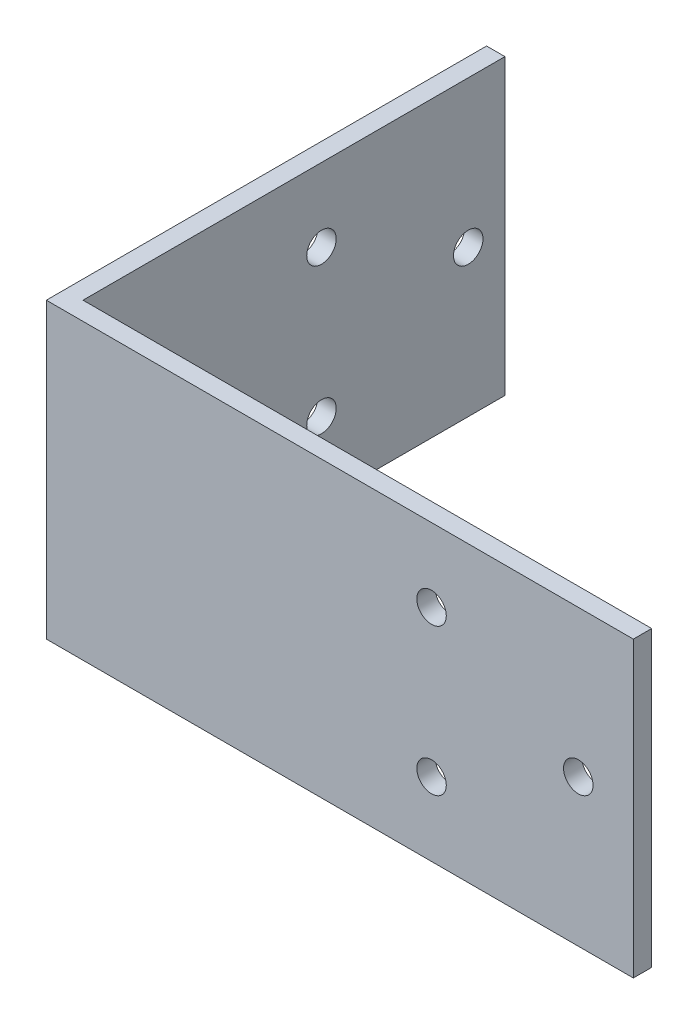
ISO-10303-21;
HEADER;
FILE_DESCRIPTION(('STEP AP214'),'2;1');
FILE_NAME('part.step','',(''),(''),'','','');
FILE_SCHEMA(('AUTOMOTIVE_DESIGN { 1 0 10303 214 1 1 1 1 }'));
ENDSEC;
DATA;
#1=APPLICATION_CONTEXT('core data for automotive mechanical design processes');
#2=APPLICATION_PROTOCOL_DEFINITION('international standard','automotive_design',2000,#1);
#3=PRODUCT_CONTEXT('',#1,'mechanical');
#4=PRODUCT('Part','Part','',(#3));
#5=PRODUCT_RELATED_PRODUCT_CATEGORY('part','',(#4));
#6=PRODUCT_DEFINITION_FORMATION('','',#4);
#7=PRODUCT_DEFINITION_CONTEXT('part definition',#1,'design');
#8=PRODUCT_DEFINITION('design','',#6,#7);
#9=PRODUCT_DEFINITION_SHAPE('','',#8);
#10=(LENGTH_UNIT() NAMED_UNIT(*) SI_UNIT(.MILLI.,.METRE.));
#11=(NAMED_UNIT(*) PLANE_ANGLE_UNIT() SI_UNIT($,.RADIAN.));
#12=(NAMED_UNIT(*) SI_UNIT($,.STERADIAN.) SOLID_ANGLE_UNIT());
#13=UNCERTAINTY_MEASURE_WITH_UNIT(LENGTH_MEASURE(1.E-05),#10,'distance_accuracy_value','');
#14=(GEOMETRIC_REPRESENTATION_CONTEXT(3) GLOBAL_UNCERTAINTY_ASSIGNED_CONTEXT((#13)) GLOBAL_UNIT_ASSIGNED_CONTEXT((#10,
#11,#12)) REPRESENTATION_CONTEXT('',''));
#15=CARTESIAN_POINT('',(0.,0.,0.));
#16=DIRECTION('',(0.,0.,1.));
#17=DIRECTION('',(1.,0.,0.));
#18=AXIS2_PLACEMENT_3D('',#15,#16,#17);
#19=CARTESIAN_POINT('',(0.,50.8,0.));
#20=DIRECTION('',(0.,0.,-1.));
#21=DIRECTION('',(-1.,0.,0.));
#22=AXIS2_PLACEMENT_3D('',#19,#20,#21);
#23=PLANE('',#22);
#24=CARTESIAN_POINT('',(66.675,12.7,0.));
#25=DIRECTION('',(0.,0.,1.));
#26=DIRECTION('',(1.,0.,0.));
#27=AXIS2_PLACEMENT_3D('',#24,#25,#26);
#28=CIRCLE('',#27,2.55270000000001);
#29=CARTESIAN_POINT('',(69.2277,12.7,0.));
#30=VERTEX_POINT('',#29);
#31=EDGE_CURVE('E150',#30,#30,#28,.T.);
#32=ORIENTED_EDGE('',*,*,#31,.F.);
#33=EDGE_LOOP('',(#32));
#34=FACE_BOUND('',#33,.T.);
#35=CARTESIAN_POINT('',(66.675,38.1,0.));
#36=DIRECTION('',(0.,0.,1.));
#37=DIRECTION('',(1.,0.,0.));
#38=AXIS2_PLACEMENT_3D('',#35,#36,#37);
#39=CIRCLE('',#38,2.55270000000001);
#40=CARTESIAN_POINT('',(69.2277,38.1,0.));
#41=VERTEX_POINT('',#40);
#42=EDGE_CURVE('E140',#41,#41,#39,.T.);
#43=ORIENTED_EDGE('',*,*,#42,.F.);
#44=EDGE_LOOP('',(#43));
#45=FACE_BOUND('',#44,.T.);
#46=CARTESIAN_POINT('',(92.075,25.4,0.));
#47=DIRECTION('',(0.,0.,1.));
#48=DIRECTION('',(1.,0.,0.));
#49=AXIS2_PLACEMENT_3D('',#46,#47,#48);
#50=CIRCLE('',#49,2.55270000000001);
#51=CARTESIAN_POINT('',(94.6277,25.4,0.));
#52=VERTEX_POINT('',#51);
#53=EDGE_CURVE('E137',#52,#52,#50,.T.);
#54=ORIENTED_EDGE('',*,*,#53,.F.);
#55=EDGE_LOOP('',(#54));
#56=FACE_BOUND('',#55,.T.);
#57=DIRECTION('',(1.,0.,0.));
#58=VECTOR('',#57,1.);
#59=CARTESIAN_POINT('',(0.,0.,0.));
#60=LINE('',#59,#58);
#61=CARTESIAN_POINT('',(0.,0.,0.));
#62=VERTEX_POINT('',#61);
#63=CARTESIAN_POINT('',(101.6,0.,0.));
#64=VERTEX_POINT('',#63);
#65=EDGE_CURVE('E119',#62,#64,#60,.T.);
#66=ORIENTED_EDGE('',*,*,#65,.T.);
#67=DIRECTION('',(0.,-1.,0.));
#68=VECTOR('',#67,1.);
#69=CARTESIAN_POINT('',(101.6,50.8,0.));
#70=LINE('',#69,#68);
#71=CARTESIAN_POINT('',(101.6,50.8,0.));
#72=VERTEX_POINT('',#71);
#73=EDGE_CURVE('E11',#72,#64,#70,.T.);
#74=ORIENTED_EDGE('',*,*,#73,.F.);
#75=DIRECTION('',(1.,0.,0.));
#76=VECTOR('',#75,1.);
#77=CARTESIAN_POINT('',(0.,50.8,0.));
#78=LINE('',#77,#76);
#79=CARTESIAN_POINT('',(0.,50.8,0.));
#80=VERTEX_POINT('',#79);
#81=EDGE_CURVE('E130',#80,#72,#78,.T.);
#82=ORIENTED_EDGE('',*,*,#81,.F.);
#83=DIRECTION('',(0.,-1.,0.));
#84=VECTOR('',#83,1.);
#85=CARTESIAN_POINT('',(0.,50.8,0.));
#86=LINE('',#85,#84);
#87=EDGE_CURVE('E115',#80,#62,#86,.T.);
#88=ORIENTED_EDGE('',*,*,#87,.T.);
#89=EDGE_LOOP('',(#66,#74,#82,#88));
#90=FACE_BOUND('',#89,.T.);
#91=ADVANCED_FACE('F33',(#34,#45,#56,#90),#23,.F.);
#92=CARTESIAN_POINT('',(101.6,50.8,0.));
#93=DIRECTION('',(-1.,0.,0.));
#94=DIRECTION('',(0.,0.,1.));
#95=AXIS2_PLACEMENT_3D('',#92,#93,#94);
#96=PLANE('',#95);
#97=DIRECTION('',(0.,0.,-1.));
#98=VECTOR('',#97,1.);
#99=CARTESIAN_POINT('',(101.6,0.,0.));
#100=LINE('',#99,#98);
#101=CARTESIAN_POINT('',(101.6,0.,-3.175));
#102=VERTEX_POINT('',#101);
#103=EDGE_CURVE('E122',#64,#102,#100,.T.);
#104=ORIENTED_EDGE('',*,*,#103,.T.);
#105=DIRECTION('',(0.,-1.,0.));
#106=VECTOR('',#105,1.);
#107=CARTESIAN_POINT('',(101.6,50.8,-3.175));
#108=LINE('',#107,#106);
#109=CARTESIAN_POINT('',(101.6,50.8,-3.175));
#110=VERTEX_POINT('',#109);
#111=EDGE_CURVE('E42',#110,#102,#108,.T.);
#112=ORIENTED_EDGE('',*,*,#111,.F.);
#113=DIRECTION('',(0.,0.,-1.));
#114=VECTOR('',#113,1.);
#115=CARTESIAN_POINT('',(101.6,50.8,0.));
#116=LINE('',#115,#114);
#117=EDGE_CURVE('E88',#72,#110,#116,.T.);
#118=ORIENTED_EDGE('',*,*,#117,.F.);
#119=ORIENTED_EDGE('',*,*,#73,.T.);
#120=EDGE_LOOP('',(#104,#112,#118,#119));
#121=FACE_BOUND('',#120,.T.);
#122=ADVANCED_FACE('F157',(#121),#96,.F.);
#123=CARTESIAN_POINT('',(3.175,50.8,-3.175));
#124=DIRECTION('',(0.,0.,1.));
#125=DIRECTION('',(1.,0.,0.));
#126=AXIS2_PLACEMENT_3D('',#123,#124,#125);
#127=PLANE('',#126);
#128=CARTESIAN_POINT('',(66.675,12.7,-3.175));
#129=DIRECTION('',(0.,0.,1.));
#130=DIRECTION('',(1.,0.,0.));
#131=AXIS2_PLACEMENT_3D('',#128,#129,#130);
#132=CIRCLE('',#131,2.55270000000001);
#133=CARTESIAN_POINT('',(69.2277,12.7,-3.175));
#134=VERTEX_POINT('',#133);
#135=EDGE_CURVE('E36',#134,#134,#132,.T.);
#136=ORIENTED_EDGE('',*,*,#135,.T.);
#137=EDGE_LOOP('',(#136));
#138=FACE_BOUND('',#137,.T.);
#139=CARTESIAN_POINT('',(66.675,38.1,-3.175));
#140=DIRECTION('',(0.,0.,1.));
#141=DIRECTION('',(1.,0.,0.));
#142=AXIS2_PLACEMENT_3D('',#139,#140,#141);
#143=CIRCLE('',#142,2.55270000000001);
#144=CARTESIAN_POINT('',(69.2277,38.1,-3.175));
#145=VERTEX_POINT('',#144);
#146=EDGE_CURVE('E138',#145,#145,#143,.T.);
#147=ORIENTED_EDGE('',*,*,#146,.T.);
#148=EDGE_LOOP('',(#147));
#149=FACE_BOUND('',#148,.T.);
#150=CARTESIAN_POINT('',(92.075,25.4,-3.175));
#151=DIRECTION('',(0.,0.,1.));
#152=DIRECTION('',(1.,0.,0.));
#153=AXIS2_PLACEMENT_3D('',#150,#151,#152);
#154=CIRCLE('',#153,2.55270000000001);
#155=CARTESIAN_POINT('',(94.6277,25.4,-3.175));
#156=VERTEX_POINT('',#155);
#157=EDGE_CURVE('E123',#156,#156,#154,.T.);
#158=ORIENTED_EDGE('',*,*,#157,.T.);
#159=EDGE_LOOP('',(#158));
#160=FACE_BOUND('',#159,.T.);
#161=DIRECTION('',(-1.,0.,0.));
#162=VECTOR('',#161,1.);
#163=CARTESIAN_POINT('',(3.175,0.,-3.175));
#164=LINE('',#163,#162);
#165=CARTESIAN_POINT('',(3.175,0.,-3.175));
#166=VERTEX_POINT('',#165);
#167=EDGE_CURVE('E125',#102,#166,#164,.T.);
#168=ORIENTED_EDGE('',*,*,#167,.T.);
#169=DIRECTION('',(0.,-1.,0.));
#170=VECTOR('',#169,1.);
#171=CARTESIAN_POINT('',(3.175,50.8,-3.175));
#172=LINE('',#171,#170);
#173=CARTESIAN_POINT('',(3.175,50.8,-3.175));
#174=VERTEX_POINT('',#173);
#175=EDGE_CURVE('E110',#174,#166,#172,.T.);
#176=ORIENTED_EDGE('',*,*,#175,.F.);
#177=DIRECTION('',(-1.,0.,0.));
#178=VECTOR('',#177,1.);
#179=CARTESIAN_POINT('',(3.175,50.8,-3.175));
#180=LINE('',#179,#178);
#181=EDGE_CURVE('E101',#110,#174,#180,.T.);
#182=ORIENTED_EDGE('',*,*,#181,.F.);
#183=ORIENTED_EDGE('',*,*,#111,.T.);
#184=EDGE_LOOP('',(#168,#176,#182,#183));
#185=FACE_BOUND('',#184,.T.);
#186=ADVANCED_FACE('F160',(#138,#149,#160,#185),#127,.F.);
#187=CARTESIAN_POINT('',(3.175,50.8,-3.175));
#188=DIRECTION('',(-1.,0.,0.));
#189=DIRECTION('',(0.,0.,1.));
#190=AXIS2_PLACEMENT_3D('',#187,#188,#189);
#191=PLANE('',#190);
#192=CARTESIAN_POINT('',(3.175,12.7,-44.45));
#193=DIRECTION('',(-1.,0.,0.));
#194=DIRECTION('',(0.,0.,1.));
#195=AXIS2_PLACEMENT_3D('',#192,#193,#194);
#196=CIRCLE('',#195,2.5527);
#197=CARTESIAN_POINT('',(3.175,12.7,-41.8973));
#198=VERTEX_POINT('',#197);
#199=EDGE_CURVE('E283',#198,#198,#196,.T.);
#200=ORIENTED_EDGE('',*,*,#199,.T.);
#201=EDGE_LOOP('',(#200));
#202=FACE_BOUND('',#201,.T.);
#203=CARTESIAN_POINT('',(3.175,38.1,-44.45));
#204=DIRECTION('',(-1.,0.,0.));
#205=DIRECTION('',(0.,0.,1.));
#206=AXIS2_PLACEMENT_3D('',#203,#204,#205);
#207=CIRCLE('',#206,2.5527);
#208=CARTESIAN_POINT('',(3.175,38.1,-41.8973));
#209=VERTEX_POINT('',#208);
#210=EDGE_CURVE('E287',#209,#209,#207,.T.);
#211=ORIENTED_EDGE('',*,*,#210,.T.);
#212=EDGE_LOOP('',(#211));
#213=FACE_BOUND('',#212,.T.);
#214=CARTESIAN_POINT('',(3.175,25.4,-69.85));
#215=DIRECTION('',(-1.,0.,0.));
#216=DIRECTION('',(0.,0.,1.));
#217=AXIS2_PLACEMENT_3D('',#214,#215,#216);
#218=CIRCLE('',#217,2.5527);
#219=CARTESIAN_POINT('',(3.175,25.4,-67.2973));
#220=VERTEX_POINT('',#219);
#221=EDGE_CURVE('E295',#220,#220,#218,.T.);
#222=ORIENTED_EDGE('',*,*,#221,.T.);
#223=EDGE_LOOP('',(#222));
#224=FACE_BOUND('',#223,.T.);
#225=DIRECTION('',(0.,0.,-1.));
#226=VECTOR('',#225,1.);
#227=CARTESIAN_POINT('',(3.175,0.,-3.175));
#228=LINE('',#227,#226);
#229=CARTESIAN_POINT('',(3.175,0.,-76.2));
#230=VERTEX_POINT('',#229);
#231=EDGE_CURVE('E109',#166,#230,#228,.T.);
#232=ORIENTED_EDGE('',*,*,#231,.T.);
#233=DIRECTION('',(0.,-1.,0.));
#234=VECTOR('',#233,1.);
#235=CARTESIAN_POINT('',(3.175,50.8,-76.2));
#236=LINE('',#235,#234);
#237=CARTESIAN_POINT('',(3.175,50.8,-76.2));
#238=VERTEX_POINT('',#237);
#239=EDGE_CURVE('E106',#238,#230,#236,.T.);
#240=ORIENTED_EDGE('',*,*,#239,.F.);
#241=DIRECTION('',(0.,0.,-1.));
#242=VECTOR('',#241,1.);
#243=CARTESIAN_POINT('',(3.175,50.8,-3.175));
#244=LINE('',#243,#242);
#245=EDGE_CURVE('E95',#174,#238,#244,.T.);
#246=ORIENTED_EDGE('',*,*,#245,.F.);
#247=ORIENTED_EDGE('',*,*,#175,.T.);
#248=EDGE_LOOP('',(#232,#240,#246,#247));
#249=FACE_BOUND('',#248,.T.);
#250=ADVANCED_FACE('F107',(#202,#213,#224,#249),#191,.F.);
#251=CARTESIAN_POINT('',(0.,50.8,-76.2));
#252=DIRECTION('',(0.,0.,1.));
#253=DIRECTION('',(1.,0.,0.));
#254=AXIS2_PLACEMENT_3D('',#251,#252,#253);
#255=PLANE('',#254);
#256=DIRECTION('',(-1.,0.,0.));
#257=VECTOR('',#256,1.);
#258=CARTESIAN_POINT('',(0.,0.,-76.2));
#259=LINE('',#258,#257);
#260=CARTESIAN_POINT('',(0.,0.,-76.2));
#261=VERTEX_POINT('',#260);
#262=EDGE_CURVE('E74',#230,#261,#259,.T.);
#263=ORIENTED_EDGE('',*,*,#262,.T.);
#264=DIRECTION('',(0.,-1.,0.));
#265=VECTOR('',#264,1.);
#266=CARTESIAN_POINT('',(0.,50.8,-76.2));
#267=LINE('',#266,#265);
#268=CARTESIAN_POINT('',(0.,50.8,-76.2));
#269=VERTEX_POINT('',#268);
#270=EDGE_CURVE('E111',#269,#261,#267,.T.);
#271=ORIENTED_EDGE('',*,*,#270,.F.);
#272=DIRECTION('',(-1.,0.,0.));
#273=VECTOR('',#272,1.);
#274=CARTESIAN_POINT('',(0.,50.8,-76.2));
#275=LINE('',#274,#273);
#276=EDGE_CURVE('E99',#238,#269,#275,.T.);
#277=ORIENTED_EDGE('',*,*,#276,.F.);
#278=ORIENTED_EDGE('',*,*,#239,.T.);
#279=EDGE_LOOP('',(#263,#271,#277,#278));
#280=FACE_BOUND('',#279,.T.);
#281=ADVANCED_FACE('F113',(#280),#255,.F.);
#282=CARTESIAN_POINT('',(0.,50.8,0.));
#283=DIRECTION('',(1.,0.,0.));
#284=DIRECTION('',(0.,0.,-1.));
#285=AXIS2_PLACEMENT_3D('',#282,#283,#284);
#286=PLANE('',#285);
#287=CARTESIAN_POINT('',(0.,12.7,-44.45));
#288=DIRECTION('',(-1.,0.,0.));
#289=DIRECTION('',(0.,0.,1.));
#290=AXIS2_PLACEMENT_3D('',#287,#288,#289);
#291=CIRCLE('',#290,2.5527);
#292=CARTESIAN_POINT('',(0.,12.7,-41.8973));
#293=VERTEX_POINT('',#292);
#294=EDGE_CURVE('E280',#293,#293,#291,.T.);
#295=ORIENTED_EDGE('',*,*,#294,.F.);
#296=EDGE_LOOP('',(#295));
#297=FACE_BOUND('',#296,.T.);
#298=CARTESIAN_POINT('',(0.,38.1,-44.45));
#299=DIRECTION('',(-1.,0.,0.));
#300=DIRECTION('',(0.,0.,1.));
#301=AXIS2_PLACEMENT_3D('',#298,#299,#300);
#302=CIRCLE('',#301,2.5527);
#303=CARTESIAN_POINT('',(0.,38.1,-41.8973));
#304=VERTEX_POINT('',#303);
#305=EDGE_CURVE('E284',#304,#304,#302,.T.);
#306=ORIENTED_EDGE('',*,*,#305,.F.);
#307=EDGE_LOOP('',(#306));
#308=FACE_BOUND('',#307,.T.);
#309=CARTESIAN_POINT('',(0.,25.4,-69.85));
#310=DIRECTION('',(-1.,0.,0.));
#311=DIRECTION('',(0.,0.,1.));
#312=AXIS2_PLACEMENT_3D('',#309,#310,#311);
#313=CIRCLE('',#312,2.5527);
#314=CARTESIAN_POINT('',(0.,25.4,-67.2973));
#315=VERTEX_POINT('',#314);
#316=EDGE_CURVE('E293',#315,#315,#313,.T.);
#317=ORIENTED_EDGE('',*,*,#316,.F.);
#318=EDGE_LOOP('',(#317));
#319=FACE_BOUND('',#318,.T.);
#320=DIRECTION('',(0.,0.,1.));
#321=VECTOR('',#320,1.);
#322=CARTESIAN_POINT('',(0.,0.,0.));
#323=LINE('',#322,#321);
#324=EDGE_CURVE('E80',#261,#62,#323,.T.);
#325=ORIENTED_EDGE('',*,*,#324,.T.);
#326=ORIENTED_EDGE('',*,*,#87,.F.);
#327=DIRECTION('',(0.,0.,1.));
#328=VECTOR('',#327,1.);
#329=CARTESIAN_POINT('',(0.,50.8,0.));
#330=LINE('',#329,#328);
#331=EDGE_CURVE('E51',#269,#80,#330,.T.);
#332=ORIENTED_EDGE('',*,*,#331,.F.);
#333=ORIENTED_EDGE('',*,*,#270,.T.);
#334=EDGE_LOOP('',(#325,#326,#332,#333));
#335=FACE_BOUND('',#334,.T.);
#336=ADVANCED_FACE('F165',(#297,#308,#319,#335),#286,.F.);
#337=CARTESIAN_POINT('',(0.,50.8,0.));
#338=DIRECTION('',(0.,1.,0.));
#339=DIRECTION('',(0.,0.,1.));
#340=AXIS2_PLACEMENT_3D('',#337,#338,#339);
#341=PLANE('',#340);
#342=ORIENTED_EDGE('',*,*,#81,.T.);
#343=ORIENTED_EDGE('',*,*,#117,.T.);
#344=ORIENTED_EDGE('',*,*,#181,.T.);
#345=ORIENTED_EDGE('',*,*,#245,.T.);
#346=ORIENTED_EDGE('',*,*,#276,.T.);
#347=ORIENTED_EDGE('',*,*,#331,.T.);
#348=EDGE_LOOP('',(#342,#343,#344,#345,#346,#347));
#349=FACE_BOUND('',#348,.T.);
#350=ADVANCED_FACE('F97',(#349),#341,.T.);
#351=CARTESIAN_POINT('',(0.,0.,0.));
#352=DIRECTION('',(0.,1.,0.));
#353=DIRECTION('',(0.,0.,1.));
#354=AXIS2_PLACEMENT_3D('',#351,#352,#353);
#355=PLANE('',#354);
#356=ORIENTED_EDGE('',*,*,#65,.F.);
#357=ORIENTED_EDGE('',*,*,#324,.F.);
#358=ORIENTED_EDGE('',*,*,#262,.F.);
#359=ORIENTED_EDGE('',*,*,#231,.F.);
#360=ORIENTED_EDGE('',*,*,#167,.F.);
#361=ORIENTED_EDGE('',*,*,#103,.F.);
#362=EDGE_LOOP('',(#356,#357,#358,#359,#360,#361));
#363=FACE_BOUND('',#362,.T.);
#364=ADVANCED_FACE('F163',(#363),#355,.F.);
#365=CARTESIAN_POINT('',(92.075,25.4,-50.8));
#366=DIRECTION('',(0.,0.,1.));
#367=DIRECTION('',(1.,0.,0.));
#368=AXIS2_PLACEMENT_3D('',#365,#366,#367);
#369=CYLINDRICAL_SURFACE('',#368,2.55270000000001);
#370=ORIENTED_EDGE('',*,*,#53,.T.);
#371=EDGE_LOOP('',(#370));
#372=FACE_BOUND('',#371,.T.);
#373=ORIENTED_EDGE('',*,*,#157,.F.);
#374=EDGE_LOOP('',(#373));
#375=FACE_BOUND('',#374,.T.);
#376=ADVANCED_FACE('F189',(#372,#375),#369,.F.);
#377=CARTESIAN_POINT('',(66.675,38.1,-50.8));
#378=DIRECTION('',(0.,0.,1.));
#379=DIRECTION('',(1.,0.,0.));
#380=AXIS2_PLACEMENT_3D('',#377,#378,#379);
#381=CYLINDRICAL_SURFACE('',#380,2.55270000000001);
#382=ORIENTED_EDGE('',*,*,#42,.T.);
#383=EDGE_LOOP('',(#382));
#384=FACE_BOUND('',#383,.T.);
#385=ORIENTED_EDGE('',*,*,#146,.F.);
#386=EDGE_LOOP('',(#385));
#387=FACE_BOUND('',#386,.T.);
#388=ADVANCED_FACE('F192',(#384,#387),#381,.F.);
#389=CARTESIAN_POINT('',(66.675,12.7,-50.8));
#390=DIRECTION('',(0.,0.,1.));
#391=DIRECTION('',(1.,0.,0.));
#392=AXIS2_PLACEMENT_3D('',#389,#390,#391);
#393=CYLINDRICAL_SURFACE('',#392,2.55270000000001);
#394=ORIENTED_EDGE('',*,*,#31,.T.);
#395=EDGE_LOOP('',(#394));
#396=FACE_BOUND('',#395,.T.);
#397=ORIENTED_EDGE('',*,*,#135,.F.);
#398=EDGE_LOOP('',(#397));
#399=FACE_BOUND('',#398,.T.);
#400=ADVANCED_FACE('F206',(#396,#399),#393,.F.);
#401=CARTESIAN_POINT('',(50.8,25.4,-69.85));
#402=DIRECTION('',(-1.,0.,0.));
#403=DIRECTION('',(0.,0.,1.));
#404=AXIS2_PLACEMENT_3D('',#401,#402,#403);
#405=CYLINDRICAL_SURFACE('',#404,2.5527);
#406=ORIENTED_EDGE('',*,*,#316,.T.);
#407=EDGE_LOOP('',(#406));
#408=FACE_BOUND('',#407,.T.);
#409=ORIENTED_EDGE('',*,*,#221,.F.);
#410=EDGE_LOOP('',(#409));
#411=FACE_BOUND('',#410,.T.);
#412=ADVANCED_FACE('F208',(#408,#411),#405,.F.);
#413=CARTESIAN_POINT('',(50.8,38.1,-44.45));
#414=DIRECTION('',(-1.,0.,0.));
#415=DIRECTION('',(0.,0.,1.));
#416=AXIS2_PLACEMENT_3D('',#413,#414,#415);
#417=CYLINDRICAL_SURFACE('',#416,2.5527);
#418=ORIENTED_EDGE('',*,*,#305,.T.);
#419=EDGE_LOOP('',(#418));
#420=FACE_BOUND('',#419,.T.);
#421=ORIENTED_EDGE('',*,*,#210,.F.);
#422=EDGE_LOOP('',(#421));
#423=FACE_BOUND('',#422,.T.);
#424=ADVANCED_FACE('F215',(#420,#423),#417,.F.);
#425=CARTESIAN_POINT('',(50.8,12.7,-44.45));
#426=DIRECTION('',(-1.,0.,0.));
#427=DIRECTION('',(0.,0.,1.));
#428=AXIS2_PLACEMENT_3D('',#425,#426,#427);
#429=CYLINDRICAL_SURFACE('',#428,2.5527);
#430=ORIENTED_EDGE('',*,*,#294,.T.);
#431=EDGE_LOOP('',(#430));
#432=FACE_BOUND('',#431,.T.);
#433=ORIENTED_EDGE('',*,*,#199,.F.);
#434=EDGE_LOOP('',(#433));
#435=FACE_BOUND('',#434,.T.);
#436=ADVANCED_FACE('F265',(#432,#435),#429,.F.);
#437=CLOSED_SHELL('',(#91,#122,#186,#250,#281,#336,#350,#364,#376,#388,#400,#412,#424,#436));
#438=MANIFOLD_SOLID_BREP('B2',#437);
#439=ADVANCED_BREP_SHAPE_REPRESENTATION('',(#18,#438),#14);
#440=SHAPE_DEFINITION_REPRESENTATION(#9,#439);
ENDSEC;
END-ISO-10303-21;
